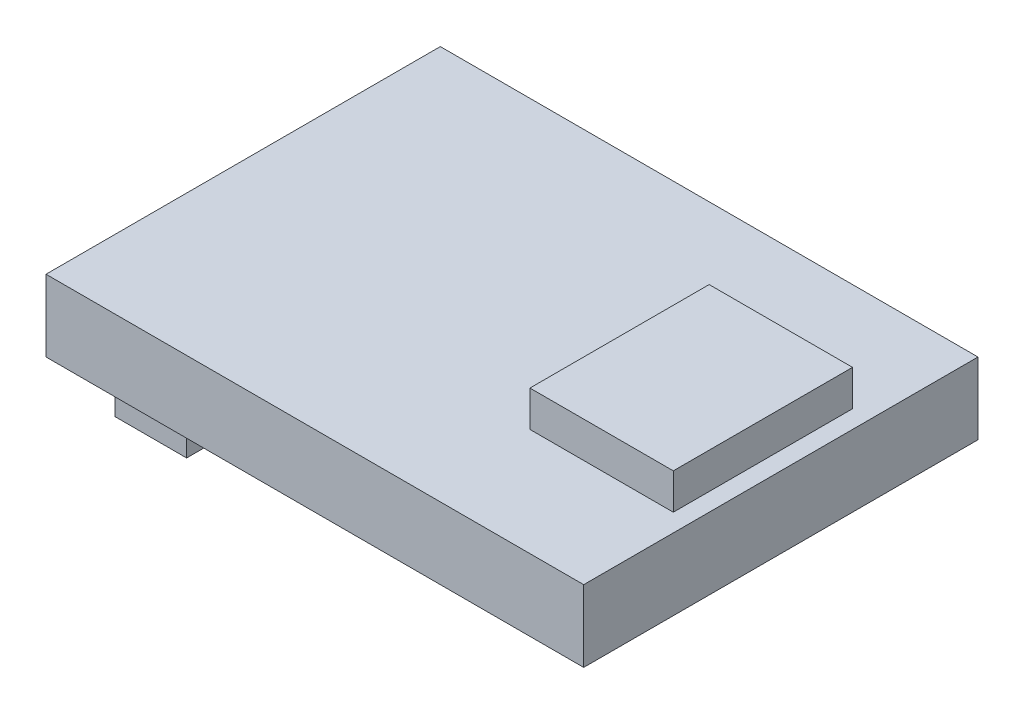
ISO-10303-21;
HEADER;
FILE_DESCRIPTION(('STEP AP214'),'2;1');
FILE_NAME('part.step','',(''),(''),'','','');
FILE_SCHEMA(('AUTOMOTIVE_DESIGN { 1 0 10303 214 1 1 1 1 }'));
ENDSEC;
DATA;
#1=APPLICATION_CONTEXT('core data for automotive mechanical design processes');
#2=APPLICATION_PROTOCOL_DEFINITION('international standard','automotive_design',2000,#1);
#3=PRODUCT_CONTEXT('',#1,'mechanical');
#4=PRODUCT('Part','Part','',(#3));
#5=PRODUCT_RELATED_PRODUCT_CATEGORY('part','',(#4));
#6=PRODUCT_DEFINITION_FORMATION('','',#4);
#7=PRODUCT_DEFINITION_CONTEXT('part definition',#1,'design');
#8=PRODUCT_DEFINITION('design','',#6,#7);
#9=PRODUCT_DEFINITION_SHAPE('','',#8);
#10=(LENGTH_UNIT() NAMED_UNIT(*) SI_UNIT(.MILLI.,.METRE.));
#11=(NAMED_UNIT(*) PLANE_ANGLE_UNIT() SI_UNIT($,.RADIAN.));
#12=(NAMED_UNIT(*) SI_UNIT($,.STERADIAN.) SOLID_ANGLE_UNIT());
#13=UNCERTAINTY_MEASURE_WITH_UNIT(LENGTH_MEASURE(1.E-05),#10,'distance_accuracy_value','');
#14=(GEOMETRIC_REPRESENTATION_CONTEXT(3) GLOBAL_UNCERTAINTY_ASSIGNED_CONTEXT((#13)) GLOBAL_UNIT_ASSIGNED_CONTEXT((#10,
#11,#12)) REPRESENTATION_CONTEXT('',''));
#15=CARTESIAN_POINT('',(0.,0.,0.));
#16=DIRECTION('',(0.,0.,1.));
#17=DIRECTION('',(1.,0.,0.));
#18=AXIS2_PLACEMENT_3D('',#15,#16,#17);
#19=CARTESIAN_POINT('',(0.,0.,0.));
#20=DIRECTION('',(0.,-1.,0.));
#21=DIRECTION('',(0.,0.,-1.));
#22=AXIS2_PLACEMENT_3D('',#19,#20,#21);
#23=PLANE('',#22);
#24=DIRECTION('',(0.,0.,-1.));
#25=VECTOR('',#24,1.);
#26=CARTESIAN_POINT('',(7.5,0.,5.5));
#27=LINE('',#26,#25);
#28=CARTESIAN_POINT('',(7.5,0.,5.5));
#29=VERTEX_POINT('',#28);
#30=CARTESIAN_POINT('',(7.5,0.,-5.5));
#31=VERTEX_POINT('',#30);
#32=EDGE_CURVE('E183',#29,#31,#27,.T.);
#33=ORIENTED_EDGE('',*,*,#32,.F.);
#34=DIRECTION('',(1.,0.,0.));
#35=VECTOR('',#34,1.);
#36=CARTESIAN_POINT('',(-7.5,0.,5.5));
#37=LINE('',#36,#35);
#38=CARTESIAN_POINT('',(-7.5,0.,5.5));
#39=VERTEX_POINT('',#38);
#40=EDGE_CURVE('E188',#39,#29,#37,.T.);
#41=ORIENTED_EDGE('',*,*,#40,.F.);
#42=DIRECTION('',(0.,0.,1.));
#43=VECTOR('',#42,1.);
#44=CARTESIAN_POINT('',(-7.5,0.,5.5));
#45=LINE('',#44,#43);
#46=CARTESIAN_POINT('',(-7.5,0.,-5.5));
#47=VERTEX_POINT('',#46);
#48=EDGE_CURVE('E199',#47,#39,#45,.T.);
#49=ORIENTED_EDGE('',*,*,#48,.F.);
#50=DIRECTION('',(-1.,0.,0.));
#51=VECTOR('',#50,1.);
#52=CARTESIAN_POINT('',(-7.5,0.,-5.5));
#53=LINE('',#52,#51);
#54=EDGE_CURVE('E197',#31,#47,#53,.T.);
#55=ORIENTED_EDGE('',*,*,#54,.F.);
#56=EDGE_LOOP('',(#33,#41,#49,#55));
#57=FACE_BOUND('',#56,.T.);
#58=DIRECTION('',(-1.,0.,0.));
#59=VECTOR('',#58,1.);
#60=CARTESIAN_POINT('',(-7.09878099178697,0.,3.97830108121163));
#61=LINE('',#60,#59);
#62=CARTESIAN_POINT('',(-5.09878099178697,0.,3.97830108121163));
#63=VERTEX_POINT('',#62);
#64=CARTESIAN_POINT('',(-7.09878099178697,0.,3.97830108121163));
#65=VERTEX_POINT('',#64);
#66=EDGE_CURVE('E387',#63,#65,#61,.T.);
#67=ORIENTED_EDGE('',*,*,#66,.F.);
#68=DIRECTION('',(0.,0.,1.));
#69=VECTOR('',#68,1.);
#70=CARTESIAN_POINT('',(-5.09878099178697,0.,-3.97830108121163));
#71=LINE('',#70,#69);
#72=CARTESIAN_POINT('',(-5.09878099178697,0.,-3.97830108121163));
#73=VERTEX_POINT('',#72);
#74=EDGE_CURVE('E147',#73,#63,#71,.T.);
#75=ORIENTED_EDGE('',*,*,#74,.F.);
#76=DIRECTION('',(1.,0.,0.));
#77=VECTOR('',#76,1.);
#78=CARTESIAN_POINT('',(-7.09878099178697,0.,-3.97830108121163));
#79=LINE('',#78,#77);
#80=CARTESIAN_POINT('',(-7.09878099178697,0.,-3.97830108121163));
#81=VERTEX_POINT('',#80);
#82=EDGE_CURVE('E143',#81,#73,#79,.T.);
#83=ORIENTED_EDGE('',*,*,#82,.F.);
#84=DIRECTION('',(0.,0.,-1.));
#85=VECTOR('',#84,1.);
#86=CARTESIAN_POINT('',(-7.09878099178697,0.,-3.97830108121163));
#87=LINE('',#86,#85);
#88=EDGE_CURVE('E384',#65,#81,#87,.T.);
#89=ORIENTED_EDGE('',*,*,#88,.F.);
#90=EDGE_LOOP('',(#67,#75,#83,#89));
#91=FACE_BOUND('',#90,.T.);
#92=ADVANCED_FACE('F35',(#57,#91),#23,.T.);
#93=CARTESIAN_POINT('',(0.,2.,0.));
#94=DIRECTION('',(0.,-1.,0.));
#95=DIRECTION('',(0.,0.,-1.));
#96=AXIS2_PLACEMENT_3D('',#93,#94,#95);
#97=PLANE('',#96);
#98=DIRECTION('',(0.,0.,-1.));
#99=VECTOR('',#98,1.);
#100=CARTESIAN_POINT('',(7.5,2.,5.5));
#101=LINE('',#100,#99);
#102=CARTESIAN_POINT('',(7.5,2.,5.5));
#103=VERTEX_POINT('',#102);
#104=CARTESIAN_POINT('',(7.5,2.,-5.5));
#105=VERTEX_POINT('',#104);
#106=EDGE_CURVE('E184',#103,#105,#101,.T.);
#107=ORIENTED_EDGE('',*,*,#106,.T.);
#108=DIRECTION('',(-1.,0.,0.));
#109=VECTOR('',#108,1.);
#110=CARTESIAN_POINT('',(-7.5,2.,-5.5));
#111=LINE('',#110,#109);
#112=CARTESIAN_POINT('',(-7.5,2.,-5.5));
#113=VERTEX_POINT('',#112);
#114=EDGE_CURVE('E187',#105,#113,#111,.T.);
#115=ORIENTED_EDGE('',*,*,#114,.T.);
#116=DIRECTION('',(0.,0.,1.));
#117=VECTOR('',#116,1.);
#118=CARTESIAN_POINT('',(-7.5,2.,5.5));
#119=LINE('',#118,#117);
#120=CARTESIAN_POINT('',(-7.5,2.,5.5));
#121=VERTEX_POINT('',#120);
#122=EDGE_CURVE('E190',#113,#121,#119,.T.);
#123=ORIENTED_EDGE('',*,*,#122,.T.);
#124=DIRECTION('',(1.,0.,0.));
#125=VECTOR('',#124,1.);
#126=CARTESIAN_POINT('',(-7.5,2.,5.5));
#127=LINE('',#126,#125);
#128=EDGE_CURVE('E192',#121,#103,#127,.T.);
#129=ORIENTED_EDGE('',*,*,#128,.T.);
#130=EDGE_LOOP('',(#107,#115,#123,#129));
#131=FACE_BOUND('',#130,.T.);
#132=DIRECTION('',(0.,0.,-1.));
#133=VECTOR('',#132,1.);
#134=CARTESIAN_POINT('',(7.,2.,-2.5));
#135=LINE('',#134,#133);
#136=CARTESIAN_POINT('',(7.,2.,2.5));
#137=VERTEX_POINT('',#136);
#138=CARTESIAN_POINT('',(7.,2.,-2.5));
#139=VERTEX_POINT('',#138);
#140=EDGE_CURVE('E149',#137,#139,#135,.T.);
#141=ORIENTED_EDGE('',*,*,#140,.F.);
#142=DIRECTION('',(1.,0.,0.));
#143=VECTOR('',#142,1.);
#144=CARTESIAN_POINT('',(3.,2.,2.5));
#145=LINE('',#144,#143);
#146=CARTESIAN_POINT('',(3.,2.,2.5));
#147=VERTEX_POINT('',#146);
#148=EDGE_CURVE('E160',#147,#137,#145,.T.);
#149=ORIENTED_EDGE('',*,*,#148,.F.);
#150=DIRECTION('',(0.,0.,1.));
#151=VECTOR('',#150,1.);
#152=CARTESIAN_POINT('',(3.,2.,-2.5));
#153=LINE('',#152,#151);
#154=CARTESIAN_POINT('',(3.,2.,-2.5));
#155=VERTEX_POINT('',#154);
#156=EDGE_CURVE('E168',#155,#147,#153,.T.);
#157=ORIENTED_EDGE('',*,*,#156,.F.);
#158=DIRECTION('',(-1.,0.,0.));
#159=VECTOR('',#158,1.);
#160=CARTESIAN_POINT('',(3.,2.,-2.5));
#161=LINE('',#160,#159);
#162=EDGE_CURVE('E58',#139,#155,#161,.T.);
#163=ORIENTED_EDGE('',*,*,#162,.F.);
#164=EDGE_LOOP('',(#141,#149,#157,#163));
#165=FACE_BOUND('',#164,.T.);
#166=ADVANCED_FACE('F226',(#131,#165),#97,.F.);
#167=CARTESIAN_POINT('',(7.5,2.,5.5));
#168=DIRECTION('',(-1.,0.,0.));
#169=DIRECTION('',(0.,0.,1.));
#170=AXIS2_PLACEMENT_3D('',#167,#168,#169);
#171=PLANE('',#170);
#172=ORIENTED_EDGE('',*,*,#32,.T.);
#173=DIRECTION('',(0.,-1.,0.));
#174=VECTOR('',#173,1.);
#175=CARTESIAN_POINT('',(7.5,2.,-5.5));
#176=LINE('',#175,#174);
#177=EDGE_CURVE('E11',#105,#31,#176,.T.);
#178=ORIENTED_EDGE('',*,*,#177,.F.);
#179=ORIENTED_EDGE('',*,*,#106,.F.);
#180=DIRECTION('',(0.,-1.,0.));
#181=VECTOR('',#180,1.);
#182=CARTESIAN_POINT('',(7.5,2.,5.5));
#183=LINE('',#182,#181);
#184=EDGE_CURVE('E194',#103,#29,#183,.T.);
#185=ORIENTED_EDGE('',*,*,#184,.T.);
#186=EDGE_LOOP('',(#172,#178,#179,#185));
#187=FACE_BOUND('',#186,.T.);
#188=ADVANCED_FACE('F37',(#187),#171,.F.);
#189=CARTESIAN_POINT('',(-7.5,2.,-5.5));
#190=DIRECTION('',(0.,0.,1.));
#191=DIRECTION('',(1.,0.,0.));
#192=AXIS2_PLACEMENT_3D('',#189,#190,#191);
#193=PLANE('',#192);
#194=ORIENTED_EDGE('',*,*,#54,.T.);
#195=DIRECTION('',(0.,-1.,0.));
#196=VECTOR('',#195,1.);
#197=CARTESIAN_POINT('',(-7.5,2.,-5.5));
#198=LINE('',#197,#196);
#199=EDGE_CURVE('E43',#113,#47,#198,.T.);
#200=ORIENTED_EDGE('',*,*,#199,.F.);
#201=ORIENTED_EDGE('',*,*,#114,.F.);
#202=ORIENTED_EDGE('',*,*,#177,.T.);
#203=EDGE_LOOP('',(#194,#200,#201,#202));
#204=FACE_BOUND('',#203,.T.);
#205=ADVANCED_FACE('F227',(#204),#193,.F.);
#206=CARTESIAN_POINT('',(-7.5,2.,5.5));
#207=DIRECTION('',(1.,0.,0.));
#208=DIRECTION('',(0.,0.,-1.));
#209=AXIS2_PLACEMENT_3D('',#206,#207,#208);
#210=PLANE('',#209);
#211=ORIENTED_EDGE('',*,*,#48,.T.);
#212=DIRECTION('',(0.,-1.,0.));
#213=VECTOR('',#212,1.);
#214=CARTESIAN_POINT('',(-7.5,2.,5.5));
#215=LINE('',#214,#213);
#216=EDGE_CURVE('E204',#121,#39,#215,.T.);
#217=ORIENTED_EDGE('',*,*,#216,.F.);
#218=ORIENTED_EDGE('',*,*,#122,.F.);
#219=ORIENTED_EDGE('',*,*,#199,.T.);
#220=EDGE_LOOP('',(#211,#217,#218,#219));
#221=FACE_BOUND('',#220,.T.);
#222=ADVANCED_FACE('F211',(#221),#210,.F.);
#223=CARTESIAN_POINT('',(-7.5,2.,5.5));
#224=DIRECTION('',(0.,0.,-1.));
#225=DIRECTION('',(-1.,0.,0.));
#226=AXIS2_PLACEMENT_3D('',#223,#224,#225);
#227=PLANE('',#226);
#228=ORIENTED_EDGE('',*,*,#40,.T.);
#229=ORIENTED_EDGE('',*,*,#184,.F.);
#230=ORIENTED_EDGE('',*,*,#128,.F.);
#231=ORIENTED_EDGE('',*,*,#216,.T.);
#232=EDGE_LOOP('',(#228,#229,#230,#231));
#233=FACE_BOUND('',#232,.T.);
#234=ADVANCED_FACE('F220',(#233),#227,.F.);
#235=CARTESIAN_POINT('',(7.,3.,-2.5));
#236=DIRECTION('',(-1.,0.,0.));
#237=DIRECTION('',(0.,0.,1.));
#238=AXIS2_PLACEMENT_3D('',#235,#236,#237);
#239=PLANE('',#238);
#240=ORIENTED_EDGE('',*,*,#140,.T.);
#241=DIRECTION('',(0.,-1.,0.));
#242=VECTOR('',#241,1.);
#243=CARTESIAN_POINT('',(7.,3.,-2.5));
#244=LINE('',#243,#242);
#245=CARTESIAN_POINT('',(7.,3.,-2.5));
#246=VERTEX_POINT('',#245);
#247=EDGE_CURVE('E181',#246,#139,#244,.T.);
#248=ORIENTED_EDGE('',*,*,#247,.F.);
#249=DIRECTION('',(0.,0.,-1.));
#250=VECTOR('',#249,1.);
#251=CARTESIAN_POINT('',(7.,3.,-2.5));
#252=LINE('',#251,#250);
#253=CARTESIAN_POINT('',(7.,3.,2.5));
#254=VERTEX_POINT('',#253);
#255=EDGE_CURVE('E156',#254,#246,#252,.T.);
#256=ORIENTED_EDGE('',*,*,#255,.F.);
#257=DIRECTION('',(0.,-1.,0.));
#258=VECTOR('',#257,1.);
#259=CARTESIAN_POINT('',(7.,3.,2.5));
#260=LINE('',#259,#258);
#261=EDGE_CURVE('E165',#254,#137,#260,.T.);
#262=ORIENTED_EDGE('',*,*,#261,.T.);
#263=EDGE_LOOP('',(#240,#248,#256,#262));
#264=FACE_BOUND('',#263,.T.);
#265=ADVANCED_FACE('F243',(#264),#239,.F.);
#266=CARTESIAN_POINT('',(3.,3.,-2.5));
#267=DIRECTION('',(0.,0.,1.));
#268=DIRECTION('',(1.,0.,0.));
#269=AXIS2_PLACEMENT_3D('',#266,#267,#268);
#270=PLANE('',#269);
#271=ORIENTED_EDGE('',*,*,#162,.T.);
#272=DIRECTION('',(0.,-1.,0.));
#273=VECTOR('',#272,1.);
#274=CARTESIAN_POINT('',(3.,3.,-2.5));
#275=LINE('',#274,#273);
#276=CARTESIAN_POINT('',(3.,3.,-2.5));
#277=VERTEX_POINT('',#276);
#278=EDGE_CURVE('E178',#277,#155,#275,.T.);
#279=ORIENTED_EDGE('',*,*,#278,.F.);
#280=DIRECTION('',(-1.,0.,0.));
#281=VECTOR('',#280,1.);
#282=CARTESIAN_POINT('',(3.,3.,-2.5));
#283=LINE('',#282,#281);
#284=EDGE_CURVE('E159',#246,#277,#283,.T.);
#285=ORIENTED_EDGE('',*,*,#284,.F.);
#286=ORIENTED_EDGE('',*,*,#247,.T.);
#287=EDGE_LOOP('',(#271,#279,#285,#286));
#288=FACE_BOUND('',#287,.T.);
#289=ADVANCED_FACE('F247',(#288),#270,.F.);
#290=CARTESIAN_POINT('',(3.,3.,-2.5));
#291=DIRECTION('',(1.,0.,0.));
#292=DIRECTION('',(0.,0.,-1.));
#293=AXIS2_PLACEMENT_3D('',#290,#291,#292);
#294=PLANE('',#293);
#295=ORIENTED_EDGE('',*,*,#156,.T.);
#296=DIRECTION('',(0.,-1.,0.));
#297=VECTOR('',#296,1.);
#298=CARTESIAN_POINT('',(3.,3.,2.5));
#299=LINE('',#298,#297);
#300=CARTESIAN_POINT('',(3.,3.,2.5));
#301=VERTEX_POINT('',#300);
#302=EDGE_CURVE('E175',#301,#147,#299,.T.);
#303=ORIENTED_EDGE('',*,*,#302,.F.);
#304=DIRECTION('',(0.,0.,1.));
#305=VECTOR('',#304,1.);
#306=CARTESIAN_POINT('',(3.,3.,-2.5));
#307=LINE('',#306,#305);
#308=EDGE_CURVE('E162',#277,#301,#307,.T.);
#309=ORIENTED_EDGE('',*,*,#308,.F.);
#310=ORIENTED_EDGE('',*,*,#278,.T.);
#311=EDGE_LOOP('',(#295,#303,#309,#310));
#312=FACE_BOUND('',#311,.T.);
#313=ADVANCED_FACE('F252',(#312),#294,.F.);
#314=CARTESIAN_POINT('',(3.,3.,2.5));
#315=DIRECTION('',(0.,0.,-1.));
#316=DIRECTION('',(-1.,0.,0.));
#317=AXIS2_PLACEMENT_3D('',#314,#315,#316);
#318=PLANE('',#317);
#319=ORIENTED_EDGE('',*,*,#148,.T.);
#320=ORIENTED_EDGE('',*,*,#261,.F.);
#321=DIRECTION('',(1.,0.,0.));
#322=VECTOR('',#321,1.);
#323=CARTESIAN_POINT('',(3.,3.,2.5));
#324=LINE('',#323,#322);
#325=EDGE_CURVE('E164',#301,#254,#324,.T.);
#326=ORIENTED_EDGE('',*,*,#325,.F.);
#327=ORIENTED_EDGE('',*,*,#302,.T.);
#328=EDGE_LOOP('',(#319,#320,#326,#327));
#329=FACE_BOUND('',#328,.T.);
#330=ADVANCED_FACE('F258',(#329),#318,.F.);
#331=CARTESIAN_POINT('',(0.,3.,0.));
#332=DIRECTION('',(0.,1.,0.));
#333=DIRECTION('',(0.,0.,1.));
#334=AXIS2_PLACEMENT_3D('',#331,#332,#333);
#335=PLANE('',#334);
#336=ORIENTED_EDGE('',*,*,#255,.T.);
#337=ORIENTED_EDGE('',*,*,#284,.T.);
#338=ORIENTED_EDGE('',*,*,#308,.T.);
#339=ORIENTED_EDGE('',*,*,#325,.T.);
#340=EDGE_LOOP('',(#336,#337,#338,#339));
#341=FACE_BOUND('',#340,.T.);
#342=ADVANCED_FACE('F262',(#341),#335,.T.);
#343=CARTESIAN_POINT('',(-5.09878099178697,-2.,-3.97830108121163));
#344=DIRECTION('',(-1.,0.,0.));
#345=DIRECTION('',(0.,0.,1.));
#346=AXIS2_PLACEMENT_3D('',#343,#344,#345);
#347=PLANE('',#346);
#348=ORIENTED_EDGE('',*,*,#74,.T.);
#349=DIRECTION('',(0.,1.,0.));
#350=VECTOR('',#349,1.);
#351=CARTESIAN_POINT('',(-5.09878099178697,-2.,3.97830108121163));
#352=LINE('',#351,#350);
#353=CARTESIAN_POINT('',(-5.09878099178697,-2.,3.97830108121163));
#354=VERTEX_POINT('',#353);
#355=EDGE_CURVE('E128',#354,#63,#352,.T.);
#356=ORIENTED_EDGE('',*,*,#355,.F.);
#357=DIRECTION('',(0.,0.,1.));
#358=VECTOR('',#357,1.);
#359=CARTESIAN_POINT('',(-5.09878099178697,-2.,-3.97830108121163));
#360=LINE('',#359,#358);
#361=CARTESIAN_POINT('',(-5.09878099178697,-2.,-3.97830108121163));
#362=VERTEX_POINT('',#361);
#363=EDGE_CURVE('E135',#362,#354,#360,.T.);
#364=ORIENTED_EDGE('',*,*,#363,.F.);
#365=DIRECTION('',(0.,1.,0.));
#366=VECTOR('',#365,1.);
#367=CARTESIAN_POINT('',(-5.09878099178697,-2.,-3.97830108121163));
#368=LINE('',#367,#366);
#369=EDGE_CURVE('E382',#362,#73,#368,.T.);
#370=ORIENTED_EDGE('',*,*,#369,.T.);
#371=EDGE_LOOP('',(#348,#356,#364,#370));
#372=FACE_BOUND('',#371,.T.);
#373=ADVANCED_FACE('F145',(#372),#347,.F.);
#374=CARTESIAN_POINT('',(-7.09878099178697,-2.,3.97830108121163));
#375=DIRECTION('',(0.,0.,-1.));
#376=DIRECTION('',(-1.,0.,0.));
#377=AXIS2_PLACEMENT_3D('',#374,#375,#376);
#378=PLANE('',#377);
#379=ORIENTED_EDGE('',*,*,#66,.T.);
#380=DIRECTION('',(0.,1.,0.));
#381=VECTOR('',#380,1.);
#382=CARTESIAN_POINT('',(-7.09878099178697,-2.,3.97830108121163));
#383=LINE('',#382,#381);
#384=CARTESIAN_POINT('',(-7.09878099178697,-2.,3.97830108121163));
#385=VERTEX_POINT('',#384);
#386=EDGE_CURVE('E131',#385,#65,#383,.T.);
#387=ORIENTED_EDGE('',*,*,#386,.F.);
#388=DIRECTION('',(-1.,0.,0.));
#389=VECTOR('',#388,1.);
#390=CARTESIAN_POINT('',(-7.09878099178697,-2.,3.97830108121163));
#391=LINE('',#390,#389);
#392=EDGE_CURVE('E124',#354,#385,#391,.T.);
#393=ORIENTED_EDGE('',*,*,#392,.F.);
#394=ORIENTED_EDGE('',*,*,#355,.T.);
#395=EDGE_LOOP('',(#379,#387,#393,#394));
#396=FACE_BOUND('',#395,.T.);
#397=ADVANCED_FACE('F126',(#396),#378,.F.);
#398=CARTESIAN_POINT('',(-7.09878099178697,-2.,-3.97830108121163));
#399=DIRECTION('',(1.,0.,0.));
#400=DIRECTION('',(0.,0.,-1.));
#401=AXIS2_PLACEMENT_3D('',#398,#399,#400);
#402=PLANE('',#401);
#403=ORIENTED_EDGE('',*,*,#88,.T.);
#404=DIRECTION('',(0.,1.,0.));
#405=VECTOR('',#404,1.);
#406=CARTESIAN_POINT('',(-7.09878099178697,-2.,-3.97830108121163));
#407=LINE('',#406,#405);
#408=CARTESIAN_POINT('',(-7.09878099178697,-2.,-3.97830108121163));
#409=VERTEX_POINT('',#408);
#410=EDGE_CURVE('E50',#409,#81,#407,.T.);
#411=ORIENTED_EDGE('',*,*,#410,.F.);
#412=DIRECTION('',(0.,0.,-1.));
#413=VECTOR('',#412,1.);
#414=CARTESIAN_POINT('',(-7.09878099178697,-2.,-3.97830108121163));
#415=LINE('',#414,#413);
#416=EDGE_CURVE('E134',#385,#409,#415,.T.);
#417=ORIENTED_EDGE('',*,*,#416,.F.);
#418=ORIENTED_EDGE('',*,*,#386,.T.);
#419=EDGE_LOOP('',(#403,#411,#417,#418));
#420=FACE_BOUND('',#419,.T.);
#421=ADVANCED_FACE('F271',(#420),#402,.F.);
#422=CARTESIAN_POINT('',(-7.09878099178697,-2.,-3.97830108121163));
#423=DIRECTION('',(0.,0.,1.));
#424=DIRECTION('',(1.,0.,0.));
#425=AXIS2_PLACEMENT_3D('',#422,#423,#424);
#426=PLANE('',#425);
#427=ORIENTED_EDGE('',*,*,#82,.T.);
#428=ORIENTED_EDGE('',*,*,#369,.F.);
#429=DIRECTION('',(1.,0.,0.));
#430=VECTOR('',#429,1.);
#431=CARTESIAN_POINT('',(-7.09878099178697,-2.,-3.97830108121163));
#432=LINE('',#431,#430);
#433=EDGE_CURVE('E139',#409,#362,#432,.T.);
#434=ORIENTED_EDGE('',*,*,#433,.F.);
#435=ORIENTED_EDGE('',*,*,#410,.T.);
#436=EDGE_LOOP('',(#427,#428,#434,#435));
#437=FACE_BOUND('',#436,.T.);
#438=ADVANCED_FACE('F274',(#437),#426,.F.);
#439=CARTESIAN_POINT('',(0.,-2.,0.));
#440=DIRECTION('',(0.,1.,0.));
#441=DIRECTION('',(0.,0.,1.));
#442=AXIS2_PLACEMENT_3D('',#439,#440,#441);
#443=PLANE('',#442);
#444=ORIENTED_EDGE('',*,*,#363,.T.);
#445=ORIENTED_EDGE('',*,*,#392,.T.);
#446=ORIENTED_EDGE('',*,*,#416,.T.);
#447=ORIENTED_EDGE('',*,*,#433,.T.);
#448=EDGE_LOOP('',(#444,#445,#446,#447));
#449=FACE_BOUND('',#448,.T.);
#450=ADVANCED_FACE('F138',(#449),#443,.F.);
#451=CLOSED_SHELL('',(#92,#166,#188,#205,#222,#234,#265,#289,#313,#330,#342,#373,#397,#421,#438,#450));
#452=MANIFOLD_SOLID_BREP('B2',#451);
#453=ADVANCED_BREP_SHAPE_REPRESENTATION('',(#18,#452),#14);
#454=SHAPE_DEFINITION_REPRESENTATION(#9,#453);
ENDSEC;
END-ISO-10303-21;
